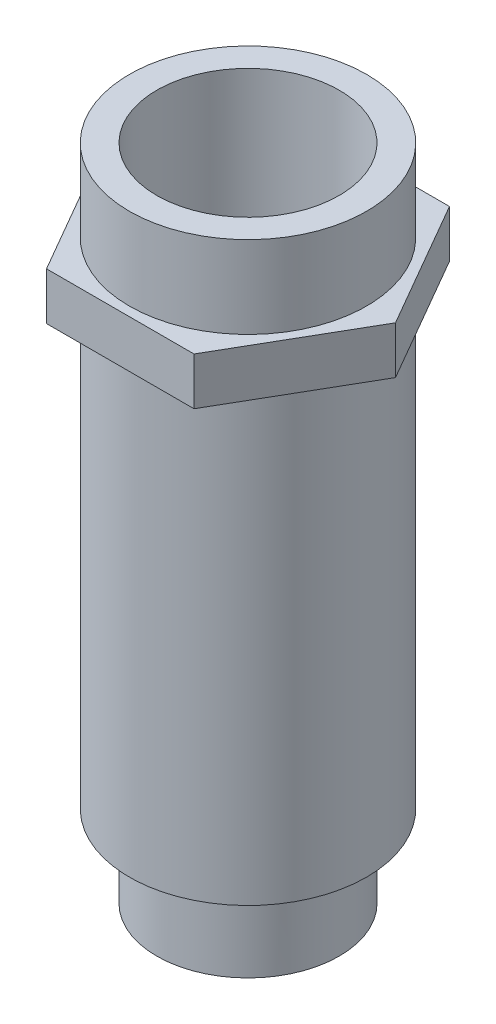
ISO-10303-21;
HEADER;
FILE_DESCRIPTION(('STEP AP214'),'2;1');
FILE_NAME('part.step','',(''),(''),'','','');
FILE_SCHEMA(('AUTOMOTIVE_DESIGN { 1 0 10303 214 1 1 1 1 }'));
ENDSEC;
DATA;
#1=APPLICATION_CONTEXT('core data for automotive mechanical design processes');
#2=APPLICATION_PROTOCOL_DEFINITION('international standard','automotive_design',2000,#1);
#3=PRODUCT_CONTEXT('',#1,'mechanical');
#4=PRODUCT('Part','Part','',(#3));
#5=PRODUCT_RELATED_PRODUCT_CATEGORY('part','',(#4));
#6=PRODUCT_DEFINITION_FORMATION('','',#4);
#7=PRODUCT_DEFINITION_CONTEXT('part definition',#1,'design');
#8=PRODUCT_DEFINITION('design','',#6,#7);
#9=PRODUCT_DEFINITION_SHAPE('','',#8);
#10=(LENGTH_UNIT() NAMED_UNIT(*) SI_UNIT(.MILLI.,.METRE.));
#11=(NAMED_UNIT(*) PLANE_ANGLE_UNIT() SI_UNIT($,.RADIAN.));
#12=(NAMED_UNIT(*) SI_UNIT($,.STERADIAN.) SOLID_ANGLE_UNIT());
#13=UNCERTAINTY_MEASURE_WITH_UNIT(LENGTH_MEASURE(1.E-05),#10,'distance_accuracy_value','');
#14=(GEOMETRIC_REPRESENTATION_CONTEXT(3) GLOBAL_UNCERTAINTY_ASSIGNED_CONTEXT((#13)) GLOBAL_UNIT_ASSIGNED_CONTEXT((#10,
#11,#12)) REPRESENTATION_CONTEXT('',''));
#15=CARTESIAN_POINT('',(0.,0.,0.));
#16=DIRECTION('',(0.,0.,1.));
#17=DIRECTION('',(1.,0.,0.));
#18=AXIS2_PLACEMENT_3D('',#15,#16,#17);
#19=CARTESIAN_POINT('',(6.5,0.,0.));
#20=DIRECTION('',(0.,1.,0.));
#21=DIRECTION('',(-1.,0.,0.));
#22=AXIS2_PLACEMENT_3D('',#19,#20,#21);
#23=PLANE('',#22);
#24=CARTESIAN_POINT('',(0.,0.,0.));
#25=DIRECTION('',(0.,1.,0.));
#26=DIRECTION('',(-1.,0.,0.));
#27=AXIS2_PLACEMENT_3D('',#24,#25,#26);
#28=CIRCLE('',#27,6.5);
#29=CARTESIAN_POINT('',(-6.5,0.,0.));
#30=VERTEX_POINT('',#29);
#31=EDGE_CURVE('E125',#30,#30,#28,.T.);
#32=ORIENTED_EDGE('',*,*,#31,.F.);
#33=EDGE_LOOP('',(#32));
#34=FACE_BOUND('',#33,.T.);
#35=CARTESIAN_POINT('',(0.,0.,0.));
#36=DIRECTION('',(0.,1.,0.));
#37=DIRECTION('',(-1.,0.,0.));
#38=AXIS2_PLACEMENT_3D('',#35,#36,#37);
#39=CIRCLE('',#38,5.);
#40=CARTESIAN_POINT('',(-5.,0.,0.));
#41=VERTEX_POINT('',#40);
#42=EDGE_CURVE('E12',#41,#41,#39,.F.);
#43=ORIENTED_EDGE('',*,*,#42,.F.);
#44=EDGE_LOOP('',(#43));
#45=FACE_BOUND('',#44,.T.);
#46=ADVANCED_FACE('F18',(#34,#45),#23,.F.);
#47=CARTESIAN_POINT('',(8.08290376865476,27.1,0.));
#48=DIRECTION('',(0.,1.,0.));
#49=DIRECTION('',(0.,0.,1.));
#50=AXIS2_PLACEMENT_3D('',#47,#48,#49);
#51=PLANE('',#50);
#52=DIRECTION('',(0.5,0.,-0.866025403784439));
#53=VECTOR('',#52,1.);
#54=CARTESIAN_POINT('',(4.04145188432738,27.1,7.));
#55=LINE('',#54,#53);
#56=CARTESIAN_POINT('',(4.04145188432738,27.1,7.));
#57=VERTEX_POINT('',#56);
#58=CARTESIAN_POINT('',(8.08290376865476,27.1,0.));
#59=VERTEX_POINT('',#58);
#60=EDGE_CURVE('E116',#57,#59,#55,.T.);
#61=ORIENTED_EDGE('',*,*,#60,.T.);
#62=DIRECTION('',(-0.5,0.,-0.866025403784439));
#63=VECTOR('',#62,1.);
#64=CARTESIAN_POINT('',(8.08290376865476,27.1,0.));
#65=LINE('',#64,#63);
#66=CARTESIAN_POINT('',(4.04145188432738,27.1,-7.));
#67=VERTEX_POINT('',#66);
#68=EDGE_CURVE('E73',#59,#67,#65,.T.);
#69=ORIENTED_EDGE('',*,*,#68,.T.);
#70=DIRECTION('',(-1.,0.,0.));
#71=VECTOR('',#70,1.);
#72=CARTESIAN_POINT('',(4.04145188432738,27.1,-7.));
#73=LINE('',#72,#71);
#74=CARTESIAN_POINT('',(-4.04145188432738,27.1,-7.));
#75=VERTEX_POINT('',#74);
#76=EDGE_CURVE('E87',#67,#75,#73,.T.);
#77=ORIENTED_EDGE('',*,*,#76,.T.);
#78=DIRECTION('',(-0.5,0.,0.866025403784439));
#79=VECTOR('',#78,1.);
#80=CARTESIAN_POINT('',(-4.04145188432738,27.1,-7.));
#81=LINE('',#80,#79);
#82=CARTESIAN_POINT('',(-8.08290376865477,27.1,0.));
#83=VERTEX_POINT('',#82);
#84=EDGE_CURVE('E80',#75,#83,#81,.T.);
#85=ORIENTED_EDGE('',*,*,#84,.T.);
#86=DIRECTION('',(0.5,0.,0.866025403784439));
#87=VECTOR('',#86,1.);
#88=CARTESIAN_POINT('',(-8.08290376865477,27.1,0.));
#89=LINE('',#88,#87);
#90=CARTESIAN_POINT('',(-4.04145188432738,27.1,7.));
#91=VERTEX_POINT('',#90);
#92=EDGE_CURVE('E85',#83,#91,#89,.T.);
#93=ORIENTED_EDGE('',*,*,#92,.T.);
#94=DIRECTION('',(1.,0.,0.));
#95=VECTOR('',#94,1.);
#96=CARTESIAN_POINT('',(-4.04145188432738,27.1,7.));
#97=LINE('',#96,#95);
#98=EDGE_CURVE('E35',#91,#57,#97,.T.);
#99=ORIENTED_EDGE('',*,*,#98,.T.);
#100=EDGE_LOOP('',(#61,#69,#77,#85,#93,#99));
#101=FACE_BOUND('',#100,.T.);
#102=CARTESIAN_POINT('',(0.,27.1,0.));
#103=DIRECTION('',(0.,1.,0.));
#104=DIRECTION('',(0.,0.,1.));
#105=AXIS2_PLACEMENT_3D('',#102,#103,#104);
#106=CIRCLE('',#105,6.5);
#107=CARTESIAN_POINT('',(0.,27.1,6.5));
#108=VERTEX_POINT('',#107);
#109=EDGE_CURVE('E194',#108,#108,#106,.T.);
#110=ORIENTED_EDGE('',*,*,#109,.F.);
#111=EDGE_LOOP('',(#110));
#112=FACE_BOUND('',#111,.T.);
#113=ADVANCED_FACE('F82',(#101,#112),#51,.T.);
#114=CARTESIAN_POINT('',(0.,24.5,0.));
#115=DIRECTION('',(0.,1.,0.));
#116=DIRECTION('',(-1.,0.,0.));
#117=AXIS2_PLACEMENT_3D('',#114,#115,#116);
#118=CYLINDRICAL_SURFACE('',#117,6.5);
#119=CARTESIAN_POINT('',(0.,24.5,0.));
#120=DIRECTION('',(0.,1.,0.));
#121=DIRECTION('',(-1.,0.,0.));
#122=AXIS2_PLACEMENT_3D('',#119,#120,#121);
#123=CIRCLE('',#122,6.5);
#124=CARTESIAN_POINT('',(-6.5,24.5,0.));
#125=VERTEX_POINT('',#124);
#126=EDGE_CURVE('E27',#125,#125,#123,.T.);
#127=ORIENTED_EDGE('',*,*,#126,.F.);
#128=EDGE_LOOP('',(#127));
#129=FACE_BOUND('',#128,.T.);
#130=ORIENTED_EDGE('',*,*,#31,.T.);
#131=EDGE_LOOP('',(#130));
#132=FACE_BOUND('',#131,.T.);
#133=ADVANCED_FACE('F20',(#129,#132),#118,.T.);
#134=CARTESIAN_POINT('',(8.08290376865476,24.5,0.));
#135=DIRECTION('',(0.,1.,0.));
#136=DIRECTION('',(0.,0.,1.));
#137=AXIS2_PLACEMENT_3D('',#134,#135,#136);
#138=PLANE('',#137);
#139=DIRECTION('',(0.5,0.,-0.866025403784439));
#140=VECTOR('',#139,1.);
#141=CARTESIAN_POINT('',(4.04145188432738,24.5,7.));
#142=LINE('',#141,#140);
#143=CARTESIAN_POINT('',(4.04145188432738,24.5,7.));
#144=VERTEX_POINT('',#143);
#145=CARTESIAN_POINT('',(8.08290376865476,24.5,0.));
#146=VERTEX_POINT('',#145);
#147=EDGE_CURVE('E105',#144,#146,#142,.T.);
#148=ORIENTED_EDGE('',*,*,#147,.F.);
#149=DIRECTION('',(1.,0.,0.));
#150=VECTOR('',#149,1.);
#151=CARTESIAN_POINT('',(-4.04145188432738,24.5,7.));
#152=LINE('',#151,#150);
#153=CARTESIAN_POINT('',(-4.04145188432738,24.5,7.));
#154=VERTEX_POINT('',#153);
#155=EDGE_CURVE('E64',#154,#144,#152,.T.);
#156=ORIENTED_EDGE('',*,*,#155,.F.);
#157=DIRECTION('',(0.5,0.,0.866025403784439));
#158=VECTOR('',#157,1.);
#159=CARTESIAN_POINT('',(-8.08290376865477,24.5,0.));
#160=LINE('',#159,#158);
#161=CARTESIAN_POINT('',(-8.08290376865477,24.5,0.));
#162=VERTEX_POINT('',#161);
#163=EDGE_CURVE('E58',#162,#154,#160,.T.);
#164=ORIENTED_EDGE('',*,*,#163,.F.);
#165=DIRECTION('',(-0.5,0.,0.866025403784439));
#166=VECTOR('',#165,1.);
#167=CARTESIAN_POINT('',(-4.04145188432738,24.5,-7.));
#168=LINE('',#167,#166);
#169=CARTESIAN_POINT('',(-4.04145188432738,24.5,-7.));
#170=VERTEX_POINT('',#169);
#171=EDGE_CURVE('E95',#170,#162,#168,.T.);
#172=ORIENTED_EDGE('',*,*,#171,.F.);
#173=DIRECTION('',(-1.,0.,0.));
#174=VECTOR('',#173,1.);
#175=CARTESIAN_POINT('',(4.04145188432738,24.5,-7.));
#176=LINE('',#175,#174);
#177=CARTESIAN_POINT('',(4.04145188432738,24.5,-7.));
#178=VERTEX_POINT('',#177);
#179=EDGE_CURVE('E111',#178,#170,#176,.T.);
#180=ORIENTED_EDGE('',*,*,#179,.F.);
#181=DIRECTION('',(-0.5,0.,-0.866025403784439));
#182=VECTOR('',#181,1.);
#183=CARTESIAN_POINT('',(8.08290376865476,24.5,0.));
#184=LINE('',#183,#182);
#185=EDGE_CURVE('E108',#146,#178,#184,.T.);
#186=ORIENTED_EDGE('',*,*,#185,.F.);
#187=EDGE_LOOP('',(#148,#156,#164,#172,#180,#186));
#188=FACE_BOUND('',#187,.T.);
#189=ORIENTED_EDGE('',*,*,#126,.T.);
#190=EDGE_LOOP('',(#189));
#191=FACE_BOUND('',#190,.T.);
#192=ADVANCED_FACE('F130',(#188,#191),#138,.F.);
#193=CARTESIAN_POINT('',(4.04145188432738,27.1,7.));
#194=DIRECTION('',(-0.866025403784439,0.,-0.5));
#195=DIRECTION('',(-0.5,0.,0.866025403784439));
#196=AXIS2_PLACEMENT_3D('',#193,#194,#195);
#197=PLANE('',#196);
#198=ORIENTED_EDGE('',*,*,#147,.T.);
#199=DIRECTION('',(0.,-1.,0.));
#200=VECTOR('',#199,1.);
#201=CARTESIAN_POINT('',(8.08290376865476,27.1,0.));
#202=LINE('',#201,#200);
#203=EDGE_CURVE('E123',#59,#146,#202,.T.);
#204=ORIENTED_EDGE('',*,*,#203,.F.);
#205=ORIENTED_EDGE('',*,*,#60,.F.);
#206=DIRECTION('',(0.,-1.,0.));
#207=VECTOR('',#206,1.);
#208=CARTESIAN_POINT('',(4.04145188432738,27.1,7.));
#209=LINE('',#208,#207);
#210=EDGE_CURVE('E101',#57,#144,#209,.T.);
#211=ORIENTED_EDGE('',*,*,#210,.T.);
#212=EDGE_LOOP('',(#198,#204,#205,#211));
#213=FACE_BOUND('',#212,.T.);
#214=ADVANCED_FACE('F168',(#213),#197,.F.);
#215=CARTESIAN_POINT('',(8.08290376865476,27.1,0.));
#216=DIRECTION('',(-0.866025403784439,0.,0.5));
#217=DIRECTION('',(0.5,0.,0.866025403784439));
#218=AXIS2_PLACEMENT_3D('',#215,#216,#217);
#219=PLANE('',#218);
#220=ORIENTED_EDGE('',*,*,#185,.T.);
#221=DIRECTION('',(0.,-1.,0.));
#222=VECTOR('',#221,1.);
#223=CARTESIAN_POINT('',(4.04145188432738,27.1,-7.));
#224=LINE('',#223,#222);
#225=EDGE_CURVE('E120',#67,#178,#224,.T.);
#226=ORIENTED_EDGE('',*,*,#225,.F.);
#227=ORIENTED_EDGE('',*,*,#68,.F.);
#228=ORIENTED_EDGE('',*,*,#203,.T.);
#229=EDGE_LOOP('',(#220,#226,#227,#228));
#230=FACE_BOUND('',#229,.T.);
#231=ADVANCED_FACE('F179',(#230),#219,.F.);
#232=CARTESIAN_POINT('',(4.04145188432738,27.1,-7.));
#233=DIRECTION('',(0.,0.,1.));
#234=DIRECTION('',(1.,0.,0.));
#235=AXIS2_PLACEMENT_3D('',#232,#233,#234);
#236=PLANE('',#235);
#237=ORIENTED_EDGE('',*,*,#179,.T.);
#238=DIRECTION('',(0.,-1.,0.));
#239=VECTOR('',#238,1.);
#240=CARTESIAN_POINT('',(-4.04145188432738,27.1,-7.));
#241=LINE('',#240,#239);
#242=EDGE_CURVE('E96',#75,#170,#241,.T.);
#243=ORIENTED_EDGE('',*,*,#242,.F.);
#244=ORIENTED_EDGE('',*,*,#76,.F.);
#245=ORIENTED_EDGE('',*,*,#225,.T.);
#246=EDGE_LOOP('',(#237,#243,#244,#245));
#247=FACE_BOUND('',#246,.T.);
#248=ADVANCED_FACE('F176',(#247),#236,.F.);
#249=CARTESIAN_POINT('',(-4.04145188432738,27.1,-7.));
#250=DIRECTION('',(0.866025403784439,0.,0.5));
#251=DIRECTION('',(0.5,0.,-0.866025403784439));
#252=AXIS2_PLACEMENT_3D('',#249,#250,#251);
#253=PLANE('',#252);
#254=ORIENTED_EDGE('',*,*,#171,.T.);
#255=DIRECTION('',(0.,-1.,0.));
#256=VECTOR('',#255,1.);
#257=CARTESIAN_POINT('',(-8.08290376865477,27.1,0.));
#258=LINE('',#257,#256);
#259=EDGE_CURVE('E92',#83,#162,#258,.T.);
#260=ORIENTED_EDGE('',*,*,#259,.F.);
#261=ORIENTED_EDGE('',*,*,#84,.F.);
#262=ORIENTED_EDGE('',*,*,#242,.T.);
#263=EDGE_LOOP('',(#254,#260,#261,#262));
#264=FACE_BOUND('',#263,.T.);
#265=ADVANCED_FACE('F93',(#264),#253,.F.);
#266=CARTESIAN_POINT('',(-8.08290376865477,27.1,0.));
#267=DIRECTION('',(0.866025403784439,0.,-0.5));
#268=DIRECTION('',(-0.5,0.,-0.866025403784439));
#269=AXIS2_PLACEMENT_3D('',#266,#267,#268);
#270=PLANE('',#269);
#271=ORIENTED_EDGE('',*,*,#163,.T.);
#272=DIRECTION('',(0.,-1.,0.));
#273=VECTOR('',#272,1.);
#274=CARTESIAN_POINT('',(-4.04145188432738,27.1,7.));
#275=LINE('',#274,#273);
#276=EDGE_CURVE('E97',#91,#154,#275,.T.);
#277=ORIENTED_EDGE('',*,*,#276,.F.);
#278=ORIENTED_EDGE('',*,*,#92,.F.);
#279=ORIENTED_EDGE('',*,*,#259,.T.);
#280=EDGE_LOOP('',(#271,#277,#278,#279));
#281=FACE_BOUND('',#280,.T.);
#282=ADVANCED_FACE('F99',(#281),#270,.F.);
#283=CARTESIAN_POINT('',(-4.04145188432738,27.1,7.));
#284=DIRECTION('',(0.,0.,-1.));
#285=DIRECTION('',(-1.,0.,0.));
#286=AXIS2_PLACEMENT_3D('',#283,#284,#285);
#287=PLANE('',#286);
#288=ORIENTED_EDGE('',*,*,#155,.T.);
#289=ORIENTED_EDGE('',*,*,#210,.F.);
#290=ORIENTED_EDGE('',*,*,#98,.F.);
#291=ORIENTED_EDGE('',*,*,#276,.T.);
#292=EDGE_LOOP('',(#288,#289,#290,#291));
#293=FACE_BOUND('',#292,.T.);
#294=ADVANCED_FACE('F162',(#293),#287,.F.);
#295=CARTESIAN_POINT('',(0.,31.6,0.));
#296=DIRECTION('',(0.,-1.,0.));
#297=DIRECTION('',(0.,0.,-1.));
#298=AXIS2_PLACEMENT_3D('',#295,#296,#297);
#299=CYLINDRICAL_SURFACE('',#298,6.5);
#300=CARTESIAN_POINT('',(0.,31.6,0.));
#301=DIRECTION('',(0.,1.,0.));
#302=DIRECTION('',(0.,0.,1.));
#303=AXIS2_PLACEMENT_3D('',#300,#301,#302);
#304=CIRCLE('',#303,6.5);
#305=CARTESIAN_POINT('',(0.,31.6,6.5));
#306=VERTEX_POINT('',#305);
#307=EDGE_CURVE('E109',#306,#306,#304,.T.);
#308=ORIENTED_EDGE('',*,*,#307,.F.);
#309=EDGE_LOOP('',(#308));
#310=FACE_BOUND('',#309,.T.);
#311=ORIENTED_EDGE('',*,*,#109,.T.);
#312=EDGE_LOOP('',(#311));
#313=FACE_BOUND('',#312,.T.);
#314=ADVANCED_FACE('F154',(#310,#313),#299,.T.);
#315=CARTESIAN_POINT('',(0.,31.6,0.));
#316=DIRECTION('',(0.,1.,0.));
#317=DIRECTION('',(0.,0.,1.));
#318=AXIS2_PLACEMENT_3D('',#315,#316,#317);
#319=PLANE('',#318);
#320=CARTESIAN_POINT('',(0.,31.6,0.));
#321=DIRECTION('',(0.,1.,0.));
#322=DIRECTION('',(0.,0.,1.));
#323=AXIS2_PLACEMENT_3D('',#320,#321,#322);
#324=CIRCLE('',#323,5.);
#325=CARTESIAN_POINT('',(0.,31.6,5.));
#326=VERTEX_POINT('',#325);
#327=EDGE_CURVE('E211',#326,#326,#324,.T.);
#328=ORIENTED_EDGE('',*,*,#327,.F.);
#329=EDGE_LOOP('',(#328));
#330=FACE_BOUND('',#329,.T.);
#331=ORIENTED_EDGE('',*,*,#307,.T.);
#332=EDGE_LOOP('',(#331));
#333=FACE_BOUND('',#332,.T.);
#334=ADVANCED_FACE('F143',(#330,#333),#319,.T.);
#335=CARTESIAN_POINT('',(0.,-4.5,0.));
#336=DIRECTION('',(0.,1.,0.));
#337=DIRECTION('',(-1.,0.,0.));
#338=AXIS2_PLACEMENT_3D('',#335,#336,#337);
#339=CYLINDRICAL_SURFACE('',#338,5.);
#340=CARTESIAN_POINT('',(0.,-4.5,0.));
#341=DIRECTION('',(0.,-1.,0.));
#342=DIRECTION('',(1.,0.,0.));
#343=AXIS2_PLACEMENT_3D('',#340,#341,#342);
#344=CIRCLE('',#343,5.);
#345=CARTESIAN_POINT('',(5.,-4.5,0.));
#346=VERTEX_POINT('',#345);
#347=EDGE_CURVE('E197',#346,#346,#344,.T.);
#348=ORIENTED_EDGE('',*,*,#347,.F.);
#349=EDGE_LOOP('',(#348));
#350=FACE_BOUND('',#349,.T.);
#351=ORIENTED_EDGE('',*,*,#42,.T.);
#352=EDGE_LOOP('',(#351));
#353=FACE_BOUND('',#352,.T.);
#354=ADVANCED_FACE('F140',(#350,#353),#339,.T.);
#355=CARTESIAN_POINT('',(0.,-4.5,0.));
#356=DIRECTION('',(0.,-1.,0.));
#357=DIRECTION('',(1.,0.,0.));
#358=AXIS2_PLACEMENT_3D('',#355,#356,#357);
#359=PLANE('',#358);
#360=CARTESIAN_POINT('',(0.,-4.5,0.));
#361=DIRECTION('',(0.,-1.,0.));
#362=DIRECTION('',(1.,0.,0.));
#363=AXIS2_PLACEMENT_3D('',#360,#361,#362);
#364=CIRCLE('',#363,3.);
#365=CARTESIAN_POINT('',(3.,-4.5,0.));
#366=VERTEX_POINT('',#365);
#367=EDGE_CURVE('E203',#366,#366,#364,.T.);
#368=ORIENTED_EDGE('',*,*,#367,.F.);
#369=EDGE_LOOP('',(#368));
#370=FACE_BOUND('',#369,.T.);
#371=ORIENTED_EDGE('',*,*,#347,.T.);
#372=EDGE_LOOP('',(#371));
#373=FACE_BOUND('',#372,.T.);
#374=ADVANCED_FACE('F142',(#370,#373),#359,.T.);
#375=CARTESIAN_POINT('',(0.,-3.,0.));
#376=DIRECTION('',(0.,-1.,0.));
#377=DIRECTION('',(1.,0.,0.));
#378=AXIS2_PLACEMENT_3D('',#375,#376,#377);
#379=CYLINDRICAL_SURFACE('',#378,3.);
#380=CARTESIAN_POINT('',(0.,-3.,0.));
#381=DIRECTION('',(0.,-1.,0.));
#382=DIRECTION('',(1.,0.,0.));
#383=AXIS2_PLACEMENT_3D('',#380,#381,#382);
#384=CIRCLE('',#383,3.);
#385=CARTESIAN_POINT('',(3.,-3.,0.));
#386=VERTEX_POINT('',#385);
#387=EDGE_CURVE('E202',#386,#386,#384,.T.);
#388=ORIENTED_EDGE('',*,*,#387,.F.);
#389=EDGE_LOOP('',(#388));
#390=FACE_BOUND('',#389,.T.);
#391=ORIENTED_EDGE('',*,*,#367,.T.);
#392=EDGE_LOOP('',(#391));
#393=FACE_BOUND('',#392,.T.);
#394=ADVANCED_FACE('F151',(#390,#393),#379,.F.);
#395=CARTESIAN_POINT('',(0.,-3.,0.));
#396=DIRECTION('',(0.,-1.,0.));
#397=DIRECTION('',(1.,0.,0.));
#398=AXIS2_PLACEMENT_3D('',#395,#396,#397);
#399=PLANE('',#398);
#400=CARTESIAN_POINT('',(0.,-3.,0.));
#401=DIRECTION('',(0.,-1.,0.));
#402=DIRECTION('',(0.,0.,-1.));
#403=AXIS2_PLACEMENT_3D('',#400,#401,#402);
#404=CIRCLE('',#403,1.5);
#405=CARTESIAN_POINT('',(0.,-3.,-1.5));
#406=VERTEX_POINT('',#405);
#407=EDGE_CURVE('E223',#406,#406,#404,.T.);
#408=ORIENTED_EDGE('',*,*,#407,.F.);
#409=EDGE_LOOP('',(#408));
#410=FACE_BOUND('',#409,.T.);
#411=ORIENTED_EDGE('',*,*,#387,.T.);
#412=EDGE_LOOP('',(#411));
#413=FACE_BOUND('',#412,.T.);
#414=ADVANCED_FACE('F229',(#410,#413),#399,.T.);
#415=CARTESIAN_POINT('',(0.,2.6,0.));
#416=DIRECTION('',(0.,-1.,0.));
#417=DIRECTION('',(1.,0.,0.));
#418=AXIS2_PLACEMENT_3D('',#415,#416,#417);
#419=PLANE('',#418);
#420=CARTESIAN_POINT('',(0.,2.6,0.));
#421=DIRECTION('',(0.,1.,0.));
#422=DIRECTION('',(-1.,0.,0.));
#423=AXIS2_PLACEMENT_3D('',#420,#421,#422);
#424=CIRCLE('',#423,3.);
#425=CARTESIAN_POINT('',(-3.,2.6,0.));
#426=VERTEX_POINT('',#425);
#427=EDGE_CURVE('E215',#426,#426,#424,.T.);
#428=ORIENTED_EDGE('',*,*,#427,.F.);
#429=EDGE_LOOP('',(#428));
#430=FACE_BOUND('',#429,.T.);
#431=CARTESIAN_POINT('',(0.,2.6,0.));
#432=DIRECTION('',(0.,-1.,0.));
#433=DIRECTION('',(1.,0.,0.));
#434=AXIS2_PLACEMENT_3D('',#431,#432,#433);
#435=CIRCLE('',#434,5.);
#436=CARTESIAN_POINT('',(5.,2.6,0.));
#437=VERTEX_POINT('',#436);
#438=EDGE_CURVE('E206',#437,#437,#435,.F.);
#439=ORIENTED_EDGE('',*,*,#438,.T.);
#440=EDGE_LOOP('',(#439));
#441=FACE_BOUND('',#440,.T.);
#442=ADVANCED_FACE('F232',(#430,#441),#419,.F.);
#443=CARTESIAN_POINT('',(0.,-18.642135623731,0.));
#444=DIRECTION('',(0.,1.,0.));
#445=DIRECTION('',(0.,0.,1.));
#446=AXIS2_PLACEMENT_3D('',#443,#444,#445);
#447=CYLINDRICAL_SURFACE('',#446,5.);
#448=ORIENTED_EDGE('',*,*,#327,.T.);
#449=EDGE_LOOP('',(#448));
#450=FACE_BOUND('',#449,.T.);
#451=ORIENTED_EDGE('',*,*,#438,.F.);
#452=EDGE_LOOP('',(#451));
#453=FACE_BOUND('',#452,.T.);
#454=ADVANCED_FACE('F245',(#450,#453),#447,.F.);
#455=CARTESIAN_POINT('',(0.,1.1,0.));
#456=DIRECTION('',(0.,1.,0.));
#457=DIRECTION('',(-1.,0.,0.));
#458=AXIS2_PLACEMENT_3D('',#455,#456,#457);
#459=CYLINDRICAL_SURFACE('',#458,3.);
#460=CARTESIAN_POINT('',(0.,1.1,0.));
#461=DIRECTION('',(0.,1.,0.));
#462=DIRECTION('',(-1.,0.,0.));
#463=AXIS2_PLACEMENT_3D('',#460,#461,#462);
#464=CIRCLE('',#463,3.);
#465=CARTESIAN_POINT('',(-3.,1.1,0.));
#466=VERTEX_POINT('',#465);
#467=EDGE_CURVE('E214',#466,#466,#464,.T.);
#468=ORIENTED_EDGE('',*,*,#467,.F.);
#469=EDGE_LOOP('',(#468));
#470=FACE_BOUND('',#469,.T.);
#471=ORIENTED_EDGE('',*,*,#427,.T.);
#472=EDGE_LOOP('',(#471));
#473=FACE_BOUND('',#472,.T.);
#474=ADVANCED_FACE('F249',(#470,#473),#459,.F.);
#475=CARTESIAN_POINT('',(0.,1.1,0.));
#476=DIRECTION('',(0.,1.,0.));
#477=DIRECTION('',(-1.,0.,0.));
#478=AXIS2_PLACEMENT_3D('',#475,#476,#477);
#479=PLANE('',#478);
#480=CARTESIAN_POINT('',(0.,1.1,0.));
#481=DIRECTION('',(0.,1.,0.));
#482=DIRECTION('',(-1.,0.,0.));
#483=AXIS2_PLACEMENT_3D('',#480,#481,#482);
#484=CIRCLE('',#483,1.49999999999999);
#485=CARTESIAN_POINT('',(-1.49999999999999,1.1,0.));
#486=VERTEX_POINT('',#485);
#487=EDGE_CURVE('E218',#486,#486,#484,.T.);
#488=ORIENTED_EDGE('',*,*,#487,.F.);
#489=EDGE_LOOP('',(#488));
#490=FACE_BOUND('',#489,.T.);
#491=ORIENTED_EDGE('',*,*,#467,.T.);
#492=EDGE_LOOP('',(#491));
#493=FACE_BOUND('',#492,.T.);
#494=ADVANCED_FACE('F253',(#490,#493),#479,.T.);
#495=CARTESIAN_POINT('',(0.,-3.,0.));
#496=DIRECTION('',(0.,-1.,0.));
#497=DIRECTION('',(0.,0.,-1.));
#498=AXIS2_PLACEMENT_3D('',#495,#496,#497);
#499=CYLINDRICAL_SURFACE('',#498,1.49999999999999);
#500=ORIENTED_EDGE('',*,*,#487,.T.);
#501=EDGE_LOOP('',(#500));
#502=FACE_BOUND('',#501,.T.);
#503=ORIENTED_EDGE('',*,*,#407,.T.);
#504=EDGE_LOOP('',(#503));
#505=FACE_BOUND('',#504,.T.);
#506=ADVANCED_FACE('F227',(#502,#505),#499,.F.);
#507=CLOSED_SHELL('',(#46,#113,#133,#192,#214,#231,#248,#265,#282,#294,#314,#334,#354,#374,#394,
#414,#442,#454,#474,#494,#506));
#508=MANIFOLD_SOLID_BREP('B1',#507);
#509=ADVANCED_BREP_SHAPE_REPRESENTATION('',(#18,#508),#14);
#510=SHAPE_DEFINITION_REPRESENTATION(#9,#509);
ENDSEC;
END-ISO-10303-21;
